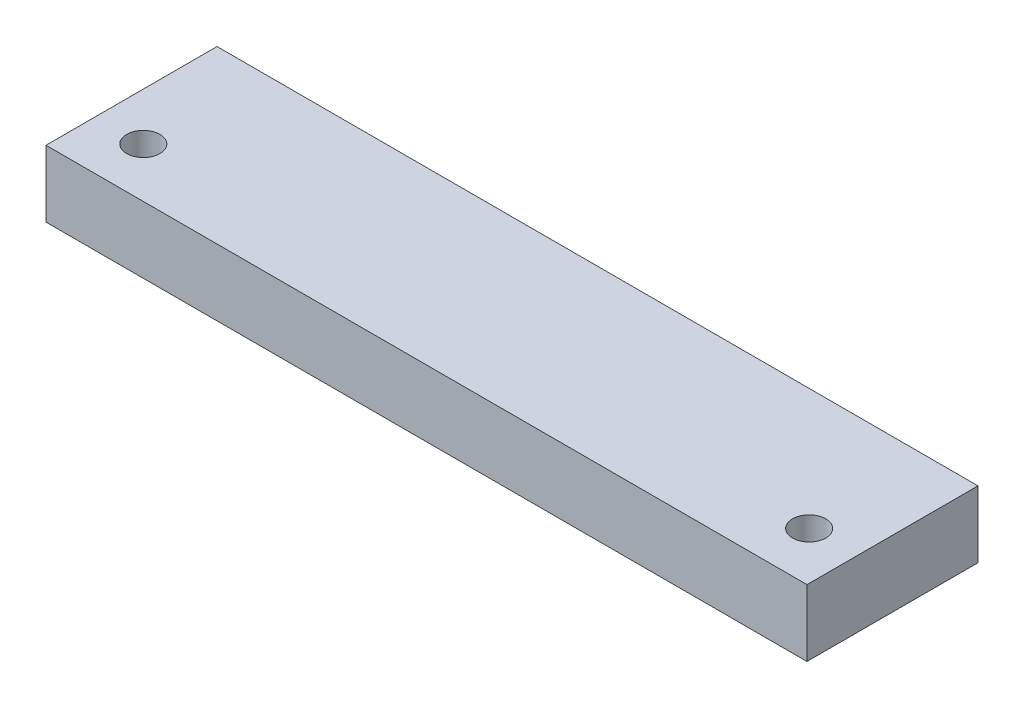
ISO-10303-21;
HEADER;
FILE_DESCRIPTION(('STEP AP214'),'2;1');
FILE_NAME('part.step','',(''),(''),'','','');
FILE_SCHEMA(('AUTOMOTIVE_DESIGN { 1 0 10303 214 1 1 1 1 }'));
ENDSEC;
DATA;
#1=APPLICATION_CONTEXT('core data for automotive mechanical design processes');
#2=APPLICATION_PROTOCOL_DEFINITION('international standard','automotive_design',2000,#1);
#3=PRODUCT_CONTEXT('',#1,'mechanical');
#4=PRODUCT('Part','Part','',(#3));
#5=PRODUCT_RELATED_PRODUCT_CATEGORY('part','',(#4));
#6=PRODUCT_DEFINITION_FORMATION('','',#4);
#7=PRODUCT_DEFINITION_CONTEXT('part definition',#1,'design');
#8=PRODUCT_DEFINITION('design','',#6,#7);
#9=PRODUCT_DEFINITION_SHAPE('','',#8);
#10=(LENGTH_UNIT() NAMED_UNIT(*) SI_UNIT(.MILLI.,.METRE.));
#11=(NAMED_UNIT(*) PLANE_ANGLE_UNIT() SI_UNIT($,.RADIAN.));
#12=(NAMED_UNIT(*) SI_UNIT($,.STERADIAN.) SOLID_ANGLE_UNIT());
#13=UNCERTAINTY_MEASURE_WITH_UNIT(LENGTH_MEASURE(1.E-05),#10,'distance_accuracy_value','');
#14=(GEOMETRIC_REPRESENTATION_CONTEXT(3) GLOBAL_UNCERTAINTY_ASSIGNED_CONTEXT((#13)) GLOBAL_UNIT_ASSIGNED_CONTEXT((#10,
#11,#12)) REPRESENTATION_CONTEXT('',''));
#15=CARTESIAN_POINT('',(0.,0.,0.));
#16=DIRECTION('',(0.,0.,1.));
#17=DIRECTION('',(1.,0.,0.));
#18=AXIS2_PLACEMENT_3D('',#15,#16,#17);
#19=CARTESIAN_POINT('',(0.,-7.,39.7613006723939));
#20=DIRECTION('',(0.,0.,1.));
#21=DIRECTION('',(1.,0.,0.));
#22=AXIS2_PLACEMENT_3D('',#19,#20,#21);
#23=PLANE('',#22);
#24=DIRECTION('',(1.,0.,0.));
#25=VECTOR('',#24,1.);
#26=CARTESIAN_POINT('',(0.,0.,39.7613006723939));
#27=LINE('',#26,#25);
#28=CARTESIAN_POINT('',(-5.26286135813548,0.,39.7613006723939));
#29=VERTEX_POINT('',#28);
#30=CARTESIAN_POINT('',(74.7371386418645,0.,39.7613006723939));
#31=VERTEX_POINT('',#30);
#32=EDGE_CURVE('E126',#29,#31,#27,.T.);
#33=ORIENTED_EDGE('',*,*,#32,.F.);
#34=DIRECTION('',(0.,1.,0.));
#35=VECTOR('',#34,1.);
#36=CARTESIAN_POINT('',(-5.26286135813548,-7.,39.7613006723939));
#37=LINE('',#36,#35);
#38=CARTESIAN_POINT('',(-5.26286135813548,-7.,39.7613006723939));
#39=VERTEX_POINT('',#38);
#40=EDGE_CURVE('E11',#39,#29,#37,.T.);
#41=ORIENTED_EDGE('',*,*,#40,.F.);
#42=DIRECTION('',(1.,0.,0.));
#43=VECTOR('',#42,1.);
#44=CARTESIAN_POINT('',(0.,-7.,39.7613006723939));
#45=LINE('',#44,#43);
#46=CARTESIAN_POINT('',(74.7371386418645,-7.,39.7613006723939));
#47=VERTEX_POINT('',#46);
#48=EDGE_CURVE('E110',#39,#47,#45,.T.);
#49=ORIENTED_EDGE('',*,*,#48,.T.);
#50=DIRECTION('',(0.,1.,0.));
#51=VECTOR('',#50,1.);
#52=CARTESIAN_POINT('',(74.7371386418645,-7.,39.7613006723939));
#53=LINE('',#52,#51);
#54=EDGE_CURVE('E48',#47,#31,#53,.T.);
#55=ORIENTED_EDGE('',*,*,#54,.T.);
#56=EDGE_LOOP('',(#33,#41,#49,#55));
#57=FACE_BOUND('',#56,.T.);
#58=ADVANCED_FACE('F45',(#57),#23,.T.);
#59=CARTESIAN_POINT('',(-5.26286135813548,-7.,0.));
#60=DIRECTION('',(1.,0.,0.));
#61=DIRECTION('',(0.,0.,-1.));
#62=AXIS2_PLACEMENT_3D('',#59,#60,#61);
#63=PLANE('',#62);
#64=DIRECTION('',(0.,0.,-1.));
#65=VECTOR('',#64,1.);
#66=CARTESIAN_POINT('',(-5.26286135813548,0.,0.));
#67=LINE('',#66,#65);
#68=CARTESIAN_POINT('',(-5.26286135813548,0.,21.7824261446982));
#69=VERTEX_POINT('',#68);
#70=EDGE_CURVE('E79',#29,#69,#67,.T.);
#71=ORIENTED_EDGE('',*,*,#70,.T.);
#72=DIRECTION('',(0.,1.,0.));
#73=VECTOR('',#72,1.);
#74=CARTESIAN_POINT('',(-5.26286135813548,-7.,21.7824261446982));
#75=LINE('',#74,#73);
#76=CARTESIAN_POINT('',(-5.26286135813548,-7.,21.7824261446982));
#77=VERTEX_POINT('',#76);
#78=EDGE_CURVE('E55',#77,#69,#75,.T.);
#79=ORIENTED_EDGE('',*,*,#78,.F.);
#80=DIRECTION('',(0.,0.,-1.));
#81=VECTOR('',#80,1.);
#82=CARTESIAN_POINT('',(-5.26286135813548,-7.,0.));
#83=LINE('',#82,#81);
#84=EDGE_CURVE('E95',#39,#77,#83,.T.);
#85=ORIENTED_EDGE('',*,*,#84,.F.);
#86=ORIENTED_EDGE('',*,*,#40,.T.);
#87=EDGE_LOOP('',(#71,#79,#85,#86));
#88=FACE_BOUND('',#87,.T.);
#89=ADVANCED_FACE('F150',(#88),#63,.F.);
#90=CARTESIAN_POINT('',(0.,-7.,21.7824261446982));
#91=DIRECTION('',(0.,0.,1.));
#92=DIRECTION('',(1.,0.,0.));
#93=AXIS2_PLACEMENT_3D('',#90,#91,#92);
#94=PLANE('',#93);
#95=DIRECTION('',(1.,0.,0.));
#96=VECTOR('',#95,1.);
#97=CARTESIAN_POINT('',(0.,0.,21.7824261446982));
#98=LINE('',#97,#96);
#99=CARTESIAN_POINT('',(74.7371386418645,0.,21.7824261446982));
#100=VERTEX_POINT('',#99);
#101=EDGE_CURVE('E103',#69,#100,#98,.T.);
#102=ORIENTED_EDGE('',*,*,#101,.T.);
#103=DIRECTION('',(0.,1.,0.));
#104=VECTOR('',#103,1.);
#105=CARTESIAN_POINT('',(74.7371386418645,-7.,21.7824261446982));
#106=LINE('',#105,#104);
#107=CARTESIAN_POINT('',(74.7371386418645,-7.,21.7824261446982));
#108=VERTEX_POINT('',#107);
#109=EDGE_CURVE('E100',#108,#100,#106,.T.);
#110=ORIENTED_EDGE('',*,*,#109,.F.);
#111=DIRECTION('',(1.,0.,0.));
#112=VECTOR('',#111,1.);
#113=CARTESIAN_POINT('',(0.,-7.,21.7824261446982));
#114=LINE('',#113,#112);
#115=EDGE_CURVE('E91',#77,#108,#114,.T.);
#116=ORIENTED_EDGE('',*,*,#115,.F.);
#117=ORIENTED_EDGE('',*,*,#78,.T.);
#118=EDGE_LOOP('',(#102,#110,#116,#117));
#119=FACE_BOUND('',#118,.T.);
#120=ADVANCED_FACE('F101',(#119),#94,.F.);
#121=CARTESIAN_POINT('',(-0.262861358135483,-7.,34.5324264856483));
#122=DIRECTION('',(0.,1.,0.));
#123=DIRECTION('',(0.,0.,1.));
#124=AXIS2_PLACEMENT_3D('',#121,#122,#123);
#125=CYLINDRICAL_SURFACE('',#124,1.75);
#126=CARTESIAN_POINT('',(-0.262861358135483,-7.,34.5324264856483));
#127=DIRECTION('',(0.,1.,0.));
#128=DIRECTION('',(0.,0.,1.));
#129=AXIS2_PLACEMENT_3D('',#126,#127,#128);
#130=CIRCLE('',#129,1.75);
#131=CARTESIAN_POINT('',(-0.262861358135483,-7.,36.2824264856483));
#132=VERTEX_POINT('',#131);
#133=EDGE_CURVE('E118',#132,#132,#130,.T.);
#134=ORIENTED_EDGE('',*,*,#133,.F.);
#135=EDGE_LOOP('',(#134));
#136=FACE_BOUND('',#135,.T.);
#137=CARTESIAN_POINT('',(-0.262861358135483,0.,34.5324264856483));
#138=DIRECTION('',(0.,1.,0.));
#139=DIRECTION('',(0.,0.,1.));
#140=AXIS2_PLACEMENT_3D('',#137,#138,#139);
#141=CIRCLE('',#140,1.75);
#142=CARTESIAN_POINT('',(-0.262861358135483,0.,36.2824264856483));
#143=VERTEX_POINT('',#142);
#144=EDGE_CURVE('E137',#143,#143,#141,.T.);
#145=ORIENTED_EDGE('',*,*,#144,.T.);
#146=EDGE_LOOP('',(#145));
#147=FACE_BOUND('',#146,.T.);
#148=ADVANCED_FACE('F158',(#136,#147),#125,.F.);
#149=CARTESIAN_POINT('',(74.7371386418645,-7.,0.));
#150=DIRECTION('',(-1.,0.,0.));
#151=DIRECTION('',(0.,0.,1.));
#152=AXIS2_PLACEMENT_3D('',#149,#150,#151);
#153=PLANE('',#152);
#154=DIRECTION('',(0.,0.,1.));
#155=VECTOR('',#154,1.);
#156=CARTESIAN_POINT('',(74.7371386418645,0.,0.));
#157=LINE('',#156,#155);
#158=EDGE_CURVE('E130',#100,#31,#157,.T.);
#159=ORIENTED_EDGE('',*,*,#158,.T.);
#160=ORIENTED_EDGE('',*,*,#54,.F.);
#161=DIRECTION('',(0.,0.,1.));
#162=VECTOR('',#161,1.);
#163=CARTESIAN_POINT('',(74.7371386418645,-7.,0.));
#164=LINE('',#163,#162);
#165=EDGE_CURVE('E88',#108,#47,#164,.T.);
#166=ORIENTED_EDGE('',*,*,#165,.F.);
#167=ORIENTED_EDGE('',*,*,#109,.T.);
#168=EDGE_LOOP('',(#159,#160,#166,#167));
#169=FACE_BOUND('',#168,.T.);
#170=ADVANCED_FACE('F108',(#169),#153,.F.);
#171=CARTESIAN_POINT('',(69.7371386418645,-7.,34.5324264856483));
#172=DIRECTION('',(0.,1.,0.));
#173=DIRECTION('',(0.,0.,1.));
#174=AXIS2_PLACEMENT_3D('',#171,#172,#173);
#175=CYLINDRICAL_SURFACE('',#174,1.75);
#176=CARTESIAN_POINT('',(69.7371386418645,-7.,34.5324264856483));
#177=DIRECTION('',(0.,1.,0.));
#178=DIRECTION('',(0.,0.,1.));
#179=AXIS2_PLACEMENT_3D('',#176,#177,#178);
#180=CIRCLE('',#179,1.75);
#181=CARTESIAN_POINT('',(69.7371386418645,-7.,36.2824264856483));
#182=VERTEX_POINT('',#181);
#183=EDGE_CURVE('E122',#182,#182,#180,.T.);
#184=ORIENTED_EDGE('',*,*,#183,.F.);
#185=EDGE_LOOP('',(#184));
#186=FACE_BOUND('',#185,.T.);
#187=CARTESIAN_POINT('',(69.7371386418645,0.,34.5324264856483));
#188=DIRECTION('',(0.,1.,0.));
#189=DIRECTION('',(0.,0.,1.));
#190=AXIS2_PLACEMENT_3D('',#187,#188,#189);
#191=CIRCLE('',#190,1.75);
#192=CARTESIAN_POINT('',(69.7371386418645,0.,36.2824264856483));
#193=VERTEX_POINT('',#192);
#194=EDGE_CURVE('E113',#193,#193,#191,.T.);
#195=ORIENTED_EDGE('',*,*,#194,.T.);
#196=EDGE_LOOP('',(#195));
#197=FACE_BOUND('',#196,.T.);
#198=ADVANCED_FACE('F163',(#186,#197),#175,.F.);
#199=CARTESIAN_POINT('',(0.,-7.,0.));
#200=DIRECTION('',(0.,1.,0.));
#201=DIRECTION('',(0.,0.,1.));
#202=AXIS2_PLACEMENT_3D('',#199,#200,#201);
#203=PLANE('',#202);
#204=ORIENTED_EDGE('',*,*,#48,.F.);
#205=ORIENTED_EDGE('',*,*,#84,.T.);
#206=ORIENTED_EDGE('',*,*,#115,.T.);
#207=ORIENTED_EDGE('',*,*,#165,.T.);
#208=EDGE_LOOP('',(#204,#205,#206,#207));
#209=FACE_BOUND('',#208,.T.);
#210=ORIENTED_EDGE('',*,*,#133,.T.);
#211=EDGE_LOOP('',(#210));
#212=FACE_BOUND('',#211,.T.);
#213=ORIENTED_EDGE('',*,*,#183,.T.);
#214=EDGE_LOOP('',(#213));
#215=FACE_BOUND('',#214,.T.);
#216=ADVANCED_FACE('F93',(#209,#212,#215),#203,.F.);
#217=CARTESIAN_POINT('',(0.,0.,0.));
#218=DIRECTION('',(0.,1.,0.));
#219=DIRECTION('',(0.,0.,1.));
#220=AXIS2_PLACEMENT_3D('',#217,#218,#219);
#221=PLANE('',#220);
#222=ORIENTED_EDGE('',*,*,#32,.T.);
#223=ORIENTED_EDGE('',*,*,#158,.F.);
#224=ORIENTED_EDGE('',*,*,#101,.F.);
#225=ORIENTED_EDGE('',*,*,#70,.F.);
#226=EDGE_LOOP('',(#222,#223,#224,#225));
#227=FACE_BOUND('',#226,.T.);
#228=ORIENTED_EDGE('',*,*,#144,.F.);
#229=EDGE_LOOP('',(#228));
#230=FACE_BOUND('',#229,.T.);
#231=ORIENTED_EDGE('',*,*,#194,.F.);
#232=EDGE_LOOP('',(#231));
#233=FACE_BOUND('',#232,.T.);
#234=ADVANCED_FACE('F146',(#227,#230,#233),#221,.T.);
#235=CLOSED_SHELL('',(#58,#89,#120,#148,#170,#198,#216,#234));
#236=MANIFOLD_SOLID_BREP('B2',#235);
#237=ADVANCED_BREP_SHAPE_REPRESENTATION('',(#18,#236),#14);
#238=SHAPE_DEFINITION_REPRESENTATION(#9,#237);
ENDSEC;
END-ISO-10303-21;
